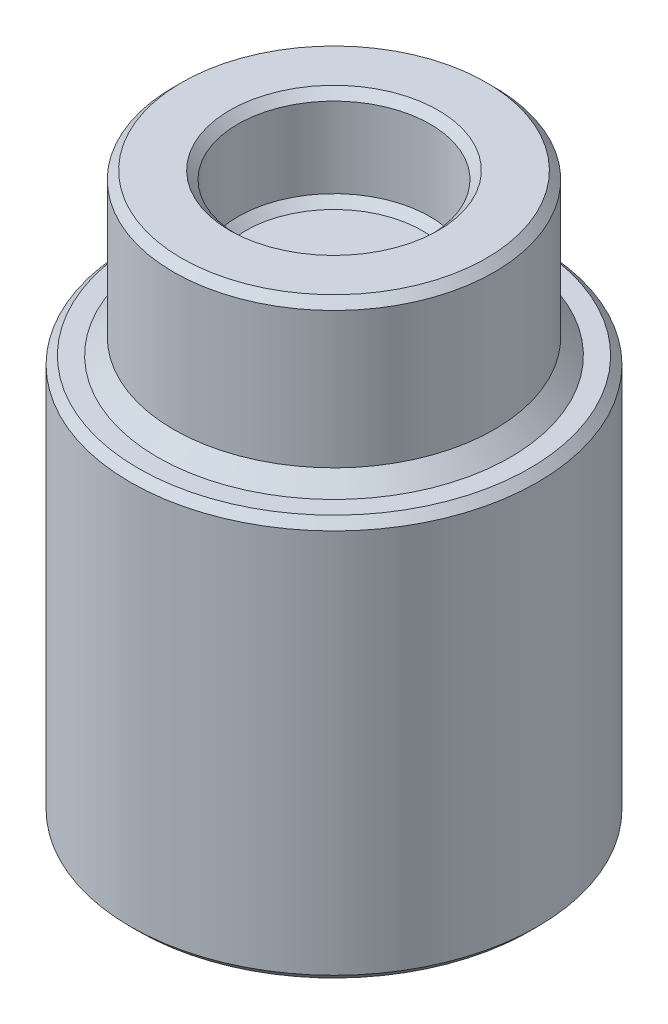
ISO-10303-21;
HEADER;
FILE_DESCRIPTION(('STEP AP214'),'2;1');
FILE_NAME('part.step','',(''),(''),'','','');
FILE_SCHEMA(('AUTOMOTIVE_DESIGN { 1 0 10303 214 1 1 1 1 }'));
ENDSEC;
DATA;
#1=APPLICATION_CONTEXT('core data for automotive mechanical design processes');
#2=APPLICATION_PROTOCOL_DEFINITION('international standard','automotive_design',2000,#1);
#3=PRODUCT_CONTEXT('',#1,'mechanical');
#4=PRODUCT('Part','Part','',(#3));
#5=PRODUCT_RELATED_PRODUCT_CATEGORY('part','',(#4));
#6=PRODUCT_DEFINITION_FORMATION('','',#4);
#7=PRODUCT_DEFINITION_CONTEXT('part definition',#1,'design');
#8=PRODUCT_DEFINITION('design','',#6,#7);
#9=PRODUCT_DEFINITION_SHAPE('','',#8);
#10=(LENGTH_UNIT() NAMED_UNIT(*) SI_UNIT(.MILLI.,.METRE.));
#11=(NAMED_UNIT(*) PLANE_ANGLE_UNIT() SI_UNIT($,.RADIAN.));
#12=(NAMED_UNIT(*) SI_UNIT($,.STERADIAN.) SOLID_ANGLE_UNIT());
#13=UNCERTAINTY_MEASURE_WITH_UNIT(LENGTH_MEASURE(1.E-05),#10,'distance_accuracy_value','');
#14=(GEOMETRIC_REPRESENTATION_CONTEXT(3) GLOBAL_UNCERTAINTY_ASSIGNED_CONTEXT((#13)) GLOBAL_UNIT_ASSIGNED_CONTEXT((#10,
#11,#12)) REPRESENTATION_CONTEXT('',''));
#15=CARTESIAN_POINT('',(0.,0.,0.));
#16=DIRECTION('',(0.,0.,1.));
#17=DIRECTION('',(1.,0.,0.));
#18=AXIS2_PLACEMENT_3D('',#15,#16,#17);
#19=CARTESIAN_POINT('',(0.,2.,0.));
#20=DIRECTION('',(0.,-1.,0.));
#21=DIRECTION('',(0.,0.,-1.));
#22=AXIS2_PLACEMENT_3D('',#19,#20,#21);
#23=CYLINDRICAL_SURFACE('',#22,5.);
#24=CARTESIAN_POINT('',(0.,0.500000000000001,0.));
#25=DIRECTION('',(0.,1.,0.));
#26=DIRECTION('',(0.,0.,1.));
#27=AXIS2_PLACEMENT_3D('',#24,#25,#26);
#28=CIRCLE('',#27,5.);
#29=CARTESIAN_POINT('',(0.,0.500000000000001,5.));
#30=VERTEX_POINT('',#29);
#31=EDGE_CURVE('E73',#30,#30,#28,.T.);
#32=ORIENTED_EDGE('',*,*,#31,.T.);
#33=EDGE_LOOP('',(#32));
#34=FACE_BOUND('',#33,.T.);
#35=CARTESIAN_POINT('',(0.,4.75,0.));
#36=DIRECTION('',(0.,1.,0.));
#37=DIRECTION('',(0.,0.,1.));
#38=AXIS2_PLACEMENT_3D('',#35,#36,#37);
#39=CIRCLE('',#38,5.);
#40=CARTESIAN_POINT('',(0.,4.75,5.));
#41=VERTEX_POINT('',#40);
#42=EDGE_CURVE('E105',#41,#41,#39,.F.);
#43=ORIENTED_EDGE('',*,*,#42,.T.);
#44=EDGE_LOOP('',(#43));
#45=FACE_BOUND('',#44,.T.);
#46=ADVANCED_FACE('F65',(#34,#45),#23,.T.);
#47=CARTESIAN_POINT('',(0.,5.,0.));
#48=DIRECTION('',(0.,1.,0.));
#49=DIRECTION('',(0.,0.,1.));
#50=AXIS2_PLACEMENT_3D('',#47,#48,#49);
#51=PLANE('',#50);
#52=CARTESIAN_POINT('',(0.,5.,0.));
#53=DIRECTION('',(0.,1.,0.));
#54=DIRECTION('',(0.,0.,1.));
#55=AXIS2_PLACEMENT_3D('',#52,#53,#54);
#56=CIRCLE('',#55,3.25);
#57=CARTESIAN_POINT('',(0.,5.,3.25));
#58=VERTEX_POINT('',#57);
#59=EDGE_CURVE('E102',#58,#58,#56,.F.);
#60=ORIENTED_EDGE('',*,*,#59,.T.);
#61=EDGE_LOOP('',(#60));
#62=FACE_BOUND('',#61,.T.);
#63=CARTESIAN_POINT('',(0.,5.,0.));
#64=DIRECTION('',(0.,1.,0.));
#65=DIRECTION('',(0.,0.,1.));
#66=AXIS2_PLACEMENT_3D('',#63,#64,#65);
#67=CIRCLE('',#66,4.75);
#68=CARTESIAN_POINT('',(0.,5.,4.75));
#69=VERTEX_POINT('',#68);
#70=EDGE_CURVE('E99',#69,#69,#67,.T.);
#71=ORIENTED_EDGE('',*,*,#70,.T.);
#72=EDGE_LOOP('',(#71));
#73=FACE_BOUND('',#72,.T.);
#74=ADVANCED_FACE('F138',(#62,#73),#51,.T.);
#75=CARTESIAN_POINT('',(0.,5.,0.));
#76=DIRECTION('',(0.,-1.,0.));
#77=DIRECTION('',(0.,0.,-1.));
#78=AXIS2_PLACEMENT_3D('',#75,#76,#77);
#79=CYLINDRICAL_SURFACE('',#78,3.);
#80=CARTESIAN_POINT('',(0.,4.75,0.));
#81=DIRECTION('',(0.,1.,0.));
#82=DIRECTION('',(0.,0.,1.));
#83=AXIS2_PLACEMENT_3D('',#80,#81,#82);
#84=CIRCLE('',#83,3.);
#85=CARTESIAN_POINT('',(0.,4.75,3.));
#86=VERTEX_POINT('',#85);
#87=EDGE_CURVE('E90',#86,#86,#84,.T.);
#88=ORIENTED_EDGE('',*,*,#87,.T.);
#89=EDGE_LOOP('',(#88));
#90=FACE_BOUND('',#89,.T.);
#91=CARTESIAN_POINT('',(0.,2.25,0.));
#92=DIRECTION('',(0.,1.,0.));
#93=DIRECTION('',(0.,0.,1.));
#94=AXIS2_PLACEMENT_3D('',#91,#92,#93);
#95=CIRCLE('',#94,3.);
#96=CARTESIAN_POINT('',(0.,2.25,3.));
#97=VERTEX_POINT('',#96);
#98=EDGE_CURVE('E86',#97,#97,#95,.F.);
#99=ORIENTED_EDGE('',*,*,#98,.T.);
#100=EDGE_LOOP('',(#99));
#101=FACE_BOUND('',#100,.T.);
#102=ADVANCED_FACE('F143',(#90,#101),#79,.F.);
#103=CARTESIAN_POINT('',(0.,2.,0.));
#104=DIRECTION('',(0.,1.,0.));
#105=DIRECTION('',(0.,0.,1.));
#106=AXIS2_PLACEMENT_3D('',#103,#104,#105);
#107=PLANE('',#106);
#108=CARTESIAN_POINT('',(0.,2.,0.));
#109=DIRECTION('',(0.,1.,0.));
#110=DIRECTION('',(0.,0.,1.));
#111=AXIS2_PLACEMENT_3D('',#108,#109,#110);
#112=CIRCLE('',#111,2.75);
#113=CARTESIAN_POINT('',(0.,2.,2.75));
#114=VERTEX_POINT('',#113);
#115=EDGE_CURVE('E108',#114,#114,#112,.T.);
#116=ORIENTED_EDGE('',*,*,#115,.T.);
#117=EDGE_LOOP('',(#116));
#118=FACE_BOUND('',#117,.T.);
#119=ADVANCED_FACE('F148',(#118),#107,.T.);
#120=CARTESIAN_POINT('',(0.,4.75,0.));
#121=DIRECTION('',(0.,1.,0.));
#122=DIRECTION('',(0.,0.,1.));
#123=AXIS2_PLACEMENT_3D('',#120,#121,#122);
#124=CONICAL_SURFACE('',#123,3.,0.785398163397452);
#125=ORIENTED_EDGE('',*,*,#59,.F.);
#126=EDGE_LOOP('',(#125));
#127=FACE_BOUND('',#126,.T.);
#128=ORIENTED_EDGE('',*,*,#87,.F.);
#129=EDGE_LOOP('',(#128));
#130=FACE_BOUND('',#129,.T.);
#131=ADVANCED_FACE('F150',(#127,#130),#124,.F.);
#132=CARTESIAN_POINT('',(0.,5.,0.));
#133=DIRECTION('',(0.,-1.,0.));
#134=DIRECTION('',(0.,0.,-1.));
#135=AXIS2_PLACEMENT_3D('',#132,#133,#134);
#136=CONICAL_SURFACE('',#135,4.75,0.78539816339745);
#137=ORIENTED_EDGE('',*,*,#42,.F.);
#138=EDGE_LOOP('',(#137));
#139=FACE_BOUND('',#138,.T.);
#140=ORIENTED_EDGE('',*,*,#70,.F.);
#141=EDGE_LOOP('',(#140));
#142=FACE_BOUND('',#141,.T.);
#143=ADVANCED_FACE('F156',(#139,#142),#136,.T.);
#144=CARTESIAN_POINT('',(0.,2.25,0.));
#145=DIRECTION('',(0.,1.,0.));
#146=DIRECTION('',(0.,0.,1.));
#147=AXIS2_PLACEMENT_3D('',#144,#145,#146);
#148=CONICAL_SURFACE('',#147,3.,0.78539816339744);
#149=ORIENTED_EDGE('',*,*,#115,.F.);
#150=EDGE_LOOP('',(#149));
#151=FACE_BOUND('',#150,.T.);
#152=ORIENTED_EDGE('',*,*,#98,.F.);
#153=EDGE_LOOP('',(#152));
#154=FACE_BOUND('',#153,.T.);
#155=ADVANCED_FACE('F163',(#151,#154),#148,.F.);
#156=CARTESIAN_POINT('',(0.,-12.5,0.));
#157=DIRECTION('',(0.,1.,0.));
#158=DIRECTION('',(0.,0.,1.));
#159=AXIS2_PLACEMENT_3D('',#156,#157,#158);
#160=CYLINDRICAL_SURFACE('',#159,6.35);
#161=CARTESIAN_POINT('',(0.,-12.25,0.));
#162=DIRECTION('',(0.,1.,0.));
#163=DIRECTION('',(0.,0.,1.));
#164=AXIS2_PLACEMENT_3D('',#161,#162,#163);
#165=CIRCLE('',#164,6.35);
#166=CARTESIAN_POINT('',(0.,-12.25,6.35));
#167=VERTEX_POINT('',#166);
#168=EDGE_CURVE('E114',#167,#167,#165,.T.);
#169=ORIENTED_EDGE('',*,*,#168,.T.);
#170=EDGE_LOOP('',(#169));
#171=FACE_BOUND('',#170,.T.);
#172=CARTESIAN_POINT('',(0.,-0.25,0.));
#173=DIRECTION('',(0.,1.,0.));
#174=DIRECTION('',(0.,0.,1.));
#175=AXIS2_PLACEMENT_3D('',#172,#173,#174);
#176=CIRCLE('',#175,6.35);
#177=CARTESIAN_POINT('',(0.,-0.25,6.35));
#178=VERTEX_POINT('',#177);
#179=EDGE_CURVE('E111',#178,#178,#176,.F.);
#180=ORIENTED_EDGE('',*,*,#179,.T.);
#181=EDGE_LOOP('',(#180));
#182=FACE_BOUND('',#181,.T.);
#183=ADVANCED_FACE('F170',(#171,#182),#160,.T.);
#184=CARTESIAN_POINT('',(0.,-12.5,0.));
#185=DIRECTION('',(0.,1.,0.));
#186=DIRECTION('',(0.,0.,1.));
#187=AXIS2_PLACEMENT_3D('',#184,#185,#186);
#188=PLANE('',#187);
#189=CARTESIAN_POINT('',(0.,-12.5,0.));
#190=DIRECTION('',(0.,1.,0.));
#191=DIRECTION('',(0.,0.,1.));
#192=AXIS2_PLACEMENT_3D('',#189,#190,#191);
#193=CIRCLE('',#192,6.1);
#194=CARTESIAN_POINT('',(0.,-12.5,6.1));
#195=VERTEX_POINT('',#194);
#196=EDGE_CURVE('E117',#195,#195,#193,.F.);
#197=ORIENTED_EDGE('',*,*,#196,.T.);
#198=EDGE_LOOP('',(#197));
#199=FACE_BOUND('',#198,.T.);
#200=CARTESIAN_POINT('',(0.,-12.5,0.));
#201=DIRECTION('',(0.,-1.,0.));
#202=DIRECTION('',(0.,0.,-1.));
#203=AXIS2_PLACEMENT_3D('',#200,#201,#202);
#204=CIRCLE('',#203,5.3975);
#205=CARTESIAN_POINT('',(0.,-12.5,-5.3975));
#206=VERTEX_POINT('',#205);
#207=EDGE_CURVE('E93',#206,#206,#204,.T.);
#208=ORIENTED_EDGE('',*,*,#207,.F.);
#209=EDGE_LOOP('',(#208));
#210=FACE_BOUND('',#209,.T.);
#211=ADVANCED_FACE('F194',(#199,#210),#188,.F.);
#212=CARTESIAN_POINT('',(0.,0.,0.));
#213=DIRECTION('',(0.,1.,0.));
#214=DIRECTION('',(0.,0.,1.));
#215=AXIS2_PLACEMENT_3D('',#212,#213,#214);
#216=PLANE('',#215);
#217=CARTESIAN_POINT('',(0.,0.,0.));
#218=DIRECTION('',(0.,1.,0.));
#219=DIRECTION('',(0.,0.,1.));
#220=AXIS2_PLACEMENT_3D('',#217,#218,#219);
#221=CIRCLE('',#220,5.5);
#222=CARTESIAN_POINT('',(0.,0.,5.5));
#223=VERTEX_POINT('',#222);
#224=EDGE_CURVE('E12',#223,#223,#221,.F.);
#225=ORIENTED_EDGE('',*,*,#224,.T.);
#226=EDGE_LOOP('',(#225));
#227=FACE_BOUND('',#226,.T.);
#228=CARTESIAN_POINT('',(0.,0.,0.));
#229=DIRECTION('',(0.,1.,0.));
#230=DIRECTION('',(0.,0.,1.));
#231=AXIS2_PLACEMENT_3D('',#228,#229,#230);
#232=CIRCLE('',#231,6.1);
#233=CARTESIAN_POINT('',(0.,0.,6.1));
#234=VERTEX_POINT('',#233);
#235=EDGE_CURVE('E120',#234,#234,#232,.T.);
#236=ORIENTED_EDGE('',*,*,#235,.T.);
#237=EDGE_LOOP('',(#236));
#238=FACE_BOUND('',#237,.T.);
#239=ADVANCED_FACE('F80',(#227,#238),#216,.T.);
#240=CARTESIAN_POINT('',(0.,-0.416664760042212,0.));
#241=DIRECTION('',(0.,-1.,0.));
#242=DIRECTION('',(0.,0.,-1.));
#243=AXIS2_PLACEMENT_3D('',#240,#241,#242);
#244=CONICAL_SURFACE('',#243,4.7625,1.48352986419518);
#245=CARTESIAN_POINT('',(0.,0.,0.));
#246=VERTEX_POINT('',#245);
#247=VERTEX_LOOP('',#246);
#248=FACE_BOUND('',#247,.T.);
#249=CARTESIAN_POINT('',(0.,-0.416664760042212,0.));
#250=DIRECTION('',(0.,-1.,0.));
#251=DIRECTION('',(0.,0.,-1.));
#252=AXIS2_PLACEMENT_3D('',#249,#250,#251);
#253=CIRCLE('',#252,4.7625);
#254=CARTESIAN_POINT('',(0.,-0.416664760042212,-4.7625));
#255=VERTEX_POINT('',#254);
#256=EDGE_CURVE('E84',#255,#255,#253,.T.);
#257=ORIENTED_EDGE('',*,*,#256,.T.);
#258=EDGE_LOOP('',(#257));
#259=FACE_BOUND('',#258,.T.);
#260=ADVANCED_FACE('F76',(#248,#259),#244,.F.);
#261=CARTESIAN_POINT('',(0.,-12.5,0.));
#262=DIRECTION('',(0.,-1.,0.));
#263=DIRECTION('',(0.,0.,-1.));
#264=AXIS2_PLACEMENT_3D('',#261,#262,#263);
#265=CYLINDRICAL_SURFACE('',#264,4.7625);
#266=ORIENTED_EDGE('',*,*,#256,.F.);
#267=EDGE_LOOP('',(#266));
#268=FACE_BOUND('',#267,.T.);
#269=CARTESIAN_POINT('',(0.,-11.865,0.));
#270=DIRECTION('',(0.,-1.,0.));
#271=DIRECTION('',(0.,0.,-1.));
#272=AXIS2_PLACEMENT_3D('',#269,#270,#271);
#273=CIRCLE('',#272,4.7625);
#274=CARTESIAN_POINT('',(0.,-11.865,-4.7625));
#275=VERTEX_POINT('',#274);
#276=EDGE_CURVE('E87',#275,#275,#273,.T.);
#277=ORIENTED_EDGE('',*,*,#276,.T.);
#278=EDGE_LOOP('',(#277));
#279=FACE_BOUND('',#278,.T.);
#280=ADVANCED_FACE('F79',(#268,#279),#265,.F.);
#281=CARTESIAN_POINT('',(0.,-12.5,0.));
#282=DIRECTION('',(0.,-1.,0.));
#283=DIRECTION('',(0.,0.,-1.));
#284=AXIS2_PLACEMENT_3D('',#281,#282,#283);
#285=CONICAL_SURFACE('',#284,5.3975,0.785398163397451);
#286=ORIENTED_EDGE('',*,*,#276,.F.);
#287=EDGE_LOOP('',(#286));
#288=FACE_BOUND('',#287,.T.);
#289=ORIENTED_EDGE('',*,*,#207,.T.);
#290=EDGE_LOOP('',(#289));
#291=FACE_BOUND('',#290,.T.);
#292=ADVANCED_FACE('F176',(#288,#291),#285,.F.);
#293=CARTESIAN_POINT('',(0.,-12.25,0.));
#294=DIRECTION('',(0.,1.,0.));
#295=DIRECTION('',(0.,0.,1.));
#296=AXIS2_PLACEMENT_3D('',#293,#294,#295);
#297=CONICAL_SURFACE('',#296,6.35,0.785398163397454);
#298=ORIENTED_EDGE('',*,*,#196,.F.);
#299=EDGE_LOOP('',(#298));
#300=FACE_BOUND('',#299,.T.);
#301=ORIENTED_EDGE('',*,*,#168,.F.);
#302=EDGE_LOOP('',(#301));
#303=FACE_BOUND('',#302,.T.);
#304=ADVANCED_FACE('F134',(#300,#303),#297,.T.);
#305=CARTESIAN_POINT('',(0.,0.,0.));
#306=DIRECTION('',(0.,-1.,0.));
#307=DIRECTION('',(0.,0.,-1.));
#308=AXIS2_PLACEMENT_3D('',#305,#306,#307);
#309=CONICAL_SURFACE('',#308,6.1,0.785398163397445);
#310=ORIENTED_EDGE('',*,*,#179,.F.);
#311=EDGE_LOOP('',(#310));
#312=FACE_BOUND('',#311,.T.);
#313=ORIENTED_EDGE('',*,*,#235,.F.);
#314=EDGE_LOOP('',(#313));
#315=FACE_BOUND('',#314,.T.);
#316=ADVANCED_FACE('F128',(#312,#315),#309,.T.);
#317=CARTESIAN_POINT('',(0.,0.500000000000001,0.));
#318=DIRECTION('',(0.,-1.,0.));
#319=DIRECTION('',(0.,0.,-1.));
#320=AXIS2_PLACEMENT_3D('',#317,#318,#319);
#321=CONICAL_SURFACE('',#320,5.,0.785398163397445);
#322=ORIENTED_EDGE('',*,*,#224,.F.);
#323=EDGE_LOOP('',(#322));
#324=FACE_BOUND('',#323,.T.);
#325=ORIENTED_EDGE('',*,*,#31,.F.);
#326=EDGE_LOOP('',(#325));
#327=FACE_BOUND('',#326,.T.);
#328=ADVANCED_FACE('F68',(#324,#327),#321,.T.);
#329=CLOSED_SHELL('',(#46,#74,#102,#119,#131,#143,#155,#183,#211,#239,#260,#280,#292,#304,#316,#328));
#330=MANIFOLD_SOLID_BREP('B2',#329);
#331=ADVANCED_BREP_SHAPE_REPRESENTATION('',(#18,#330),#14);
#332=SHAPE_DEFINITION_REPRESENTATION(#9,#331);
ENDSEC;
END-ISO-10303-21;
